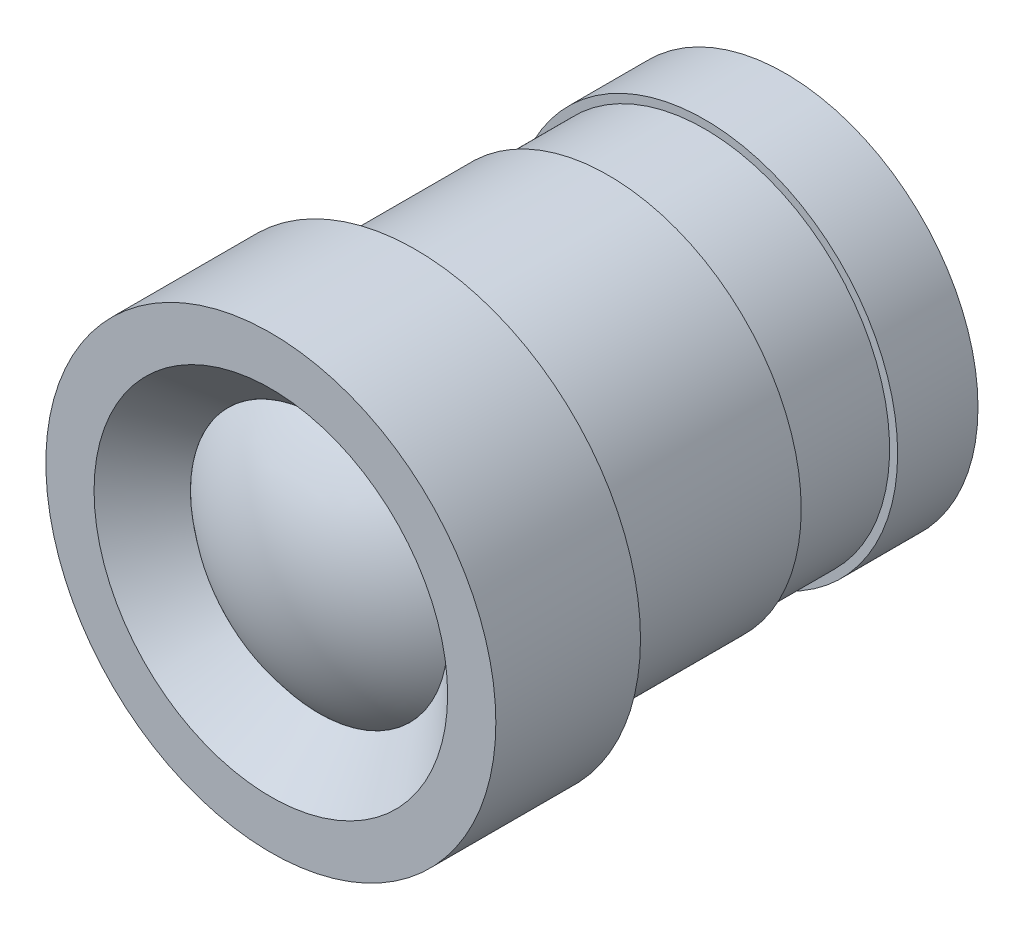
ISO-10303-21;
HEADER;
FILE_DESCRIPTION(('STEP AP214'),'2;1');
FILE_NAME('part.step','',(''),(''),'','','');
FILE_SCHEMA(('AUTOMOTIVE_DESIGN { 1 0 10303 214 1 1 1 1 }'));
ENDSEC;
DATA;
#1=APPLICATION_CONTEXT('core data for automotive mechanical design processes');
#2=APPLICATION_PROTOCOL_DEFINITION('international standard','automotive_design',2000,#1);
#3=PRODUCT_CONTEXT('',#1,'mechanical');
#4=PRODUCT('Part','Part','',(#3));
#5=PRODUCT_RELATED_PRODUCT_CATEGORY('part','',(#4));
#6=PRODUCT_DEFINITION_FORMATION('','',#4);
#7=PRODUCT_DEFINITION_CONTEXT('part definition',#1,'design');
#8=PRODUCT_DEFINITION('design','',#6,#7);
#9=PRODUCT_DEFINITION_SHAPE('','',#8);
#10=(LENGTH_UNIT() NAMED_UNIT(*) SI_UNIT(.MILLI.,.METRE.));
#11=(NAMED_UNIT(*) PLANE_ANGLE_UNIT() SI_UNIT($,.RADIAN.));
#12=(NAMED_UNIT(*) SI_UNIT($,.STERADIAN.) SOLID_ANGLE_UNIT());
#13=UNCERTAINTY_MEASURE_WITH_UNIT(LENGTH_MEASURE(1.E-05),#10,'distance_accuracy_value','');
#14=(GEOMETRIC_REPRESENTATION_CONTEXT(3) GLOBAL_UNCERTAINTY_ASSIGNED_CONTEXT((#13)) GLOBAL_UNIT_ASSIGNED_CONTEXT((#10,
#11,#12)) REPRESENTATION_CONTEXT('',''));
#15=CARTESIAN_POINT('',(0.,0.,0.));
#16=DIRECTION('',(0.,0.,1.));
#17=DIRECTION('',(1.,0.,0.));
#18=AXIS2_PLACEMENT_3D('',#15,#16,#17);
#19=CARTESIAN_POINT('',(0.,0.,-4.58333333333333));
#20=DIRECTION('',(0.,0.,1.));
#21=DIRECTION('',(-1.,0.,0.));
#22=AXIS2_PLACEMENT_3D('',#19,#20,#21);
#23=SPHERICAL_SURFACE('',#22,6.08333333333333);
#24=CARTESIAN_POINT('',(0.,0.,0.));
#25=DIRECTION('',(0.,0.,1.));
#26=DIRECTION('',(1.,0.,0.));
#27=AXIS2_PLACEMENT_3D('',#24,#25,#26);
#28=CIRCLE('',#27,4.);
#29=CARTESIAN_POINT('',(4.,0.,0.));
#30=VERTEX_POINT('',#29);
#31=EDGE_CURVE('E56',#30,#30,#28,.T.);
#32=ORIENTED_EDGE('',*,*,#31,.T.);
#33=EDGE_LOOP('',(#32));
#34=FACE_BOUND('',#33,.T.);
#35=ADVANCED_FACE('F50',(#34),#23,.T.);
#36=CARTESIAN_POINT('',(4.,0.,-14.5));
#37=DIRECTION('',(0.,0.,-1.));
#38=DIRECTION('',(-1.,0.,0.));
#39=AXIS2_PLACEMENT_3D('',#36,#37,#38);
#40=PLANE('',#39);
#41=CARTESIAN_POINT('',(0.,0.,-14.5));
#42=DIRECTION('',(0.,0.,1.));
#43=DIRECTION('',(1.,0.,0.));
#44=AXIS2_PLACEMENT_3D('',#41,#42,#43);
#45=CIRCLE('',#44,4.);
#46=CARTESIAN_POINT('',(4.,0.,-14.5));
#47=VERTEX_POINT('',#46);
#48=EDGE_CURVE('E11',#47,#47,#45,.T.);
#49=ORIENTED_EDGE('',*,*,#48,.F.);
#50=EDGE_LOOP('',(#49));
#51=FACE_BOUND('',#50,.T.);
#52=ADVANCED_FACE('F65',(#51),#40,.T.);
#53=CARTESIAN_POINT('',(0.,0.,1.5));
#54=DIRECTION('',(0.,0.,1.));
#55=DIRECTION('',(1.,0.,0.));
#56=AXIS2_PLACEMENT_3D('',#53,#54,#55);
#57=CYLINDRICAL_SURFACE('',#56,4.);
#58=ORIENTED_EDGE('',*,*,#48,.T.);
#59=EDGE_LOOP('',(#58));
#60=FACE_BOUND('',#59,.T.);
#61=ORIENTED_EDGE('',*,*,#31,.F.);
#62=EDGE_LOOP('',(#61));
#63=FACE_BOUND('',#62,.T.);
#64=ADVANCED_FACE('F63',(#60,#63),#57,.T.);
#65=CLOSED_SHELL('',(#35,#52,#64));
#66=MANIFOLD_SOLID_BREP('B2',#65);
#67=CARTESIAN_POINT('',(0.,0.,1.5));
#68=DIRECTION('',(0.,0.,1.));
#69=DIRECTION('',(1.,0.,0.));
#70=AXIS2_PLACEMENT_3D('',#67,#68,#69);
#71=CYLINDRICAL_SURFACE('',#70,6.);
#72=CARTESIAN_POINT('',(0.,0.,-3.));
#73=DIRECTION('',(0.,0.,1.));
#74=DIRECTION('',(1.,0.,0.));
#75=AXIS2_PLACEMENT_3D('',#72,#73,#74);
#76=CIRCLE('',#75,6.);
#77=CARTESIAN_POINT('',(6.,0.,-3.));
#78=VERTEX_POINT('',#77);
#79=EDGE_CURVE('E122',#78,#78,#76,.T.);
#80=ORIENTED_EDGE('',*,*,#79,.F.);
#81=EDGE_LOOP('',(#80));
#82=FACE_BOUND('',#81,.T.);
#83=CARTESIAN_POINT('',(0.,0.,-9.));
#84=DIRECTION('',(0.,0.,-1.));
#85=DIRECTION('',(-1.,0.,0.));
#86=AXIS2_PLACEMENT_3D('',#83,#84,#85);
#87=CIRCLE('',#86,6.);
#88=CARTESIAN_POINT('',(-6.,0.,-9.));
#89=VERTEX_POINT('',#88);
#90=EDGE_CURVE('E142',#89,#89,#87,.T.);
#91=ORIENTED_EDGE('',*,*,#90,.F.);
#92=EDGE_LOOP('',(#91));
#93=FACE_BOUND('',#92,.T.);
#94=ADVANCED_FACE('F109',(#82,#93),#71,.T.);
#95=CARTESIAN_POINT('',(0.,0.,1.5));
#96=DIRECTION('',(0.,0.,-1.));
#97=DIRECTION('',(-1.,0.,0.));
#98=AXIS2_PLACEMENT_3D('',#95,#96,#97);
#99=PLANE('',#98);
#100=CARTESIAN_POINT('',(0.,0.,1.5));
#101=DIRECTION('',(0.,0.,1.));
#102=DIRECTION('',(1.,0.,0.));
#103=AXIS2_PLACEMENT_3D('',#100,#101,#102);
#104=CIRCLE('',#103,5.5);
#105=CARTESIAN_POINT('',(5.5,0.,1.5));
#106=VERTEX_POINT('',#105);
#107=EDGE_CURVE('E133',#106,#106,#104,.T.);
#108=ORIENTED_EDGE('',*,*,#107,.F.);
#109=EDGE_LOOP('',(#108));
#110=FACE_BOUND('',#109,.T.);
#111=CARTESIAN_POINT('',(0.,0.,1.5));
#112=DIRECTION('',(0.,0.,1.));
#113=DIRECTION('',(1.,0.,0.));
#114=AXIS2_PLACEMENT_3D('',#111,#112,#113);
#115=CIRCLE('',#114,7.);
#116=CARTESIAN_POINT('',(7.,0.,1.5));
#117=VERTEX_POINT('',#116);
#118=EDGE_CURVE('E49',#117,#117,#115,.T.);
#119=ORIENTED_EDGE('',*,*,#118,.T.);
#120=EDGE_LOOP('',(#119));
#121=FACE_BOUND('',#120,.T.);
#122=ADVANCED_FACE('F111',(#110,#121),#99,.F.);
#123=CARTESIAN_POINT('',(0.,0.,1.5));
#124=DIRECTION('',(0.,0.,1.));
#125=DIRECTION('',(1.,0.,0.));
#126=AXIS2_PLACEMENT_3D('',#123,#124,#125);
#127=CYLINDRICAL_SURFACE('',#126,7.);
#128=ORIENTED_EDGE('',*,*,#118,.F.);
#129=EDGE_LOOP('',(#128));
#130=FACE_BOUND('',#129,.T.);
#131=CARTESIAN_POINT('',(0.,0.,-3.));
#132=DIRECTION('',(0.,0.,1.));
#133=DIRECTION('',(1.,0.,0.));
#134=AXIS2_PLACEMENT_3D('',#131,#132,#133);
#135=CIRCLE('',#134,7.);
#136=CARTESIAN_POINT('',(7.,0.,-3.));
#137=VERTEX_POINT('',#136);
#138=EDGE_CURVE('E117',#137,#137,#135,.T.);
#139=ORIENTED_EDGE('',*,*,#138,.T.);
#140=EDGE_LOOP('',(#139));
#141=FACE_BOUND('',#140,.T.);
#142=ADVANCED_FACE('F182',(#130,#141),#127,.T.);
#143=CARTESIAN_POINT('',(0.,7.,-3.));
#144=DIRECTION('',(0.,0.,1.));
#145=DIRECTION('',(1.,0.,0.));
#146=AXIS2_PLACEMENT_3D('',#143,#144,#145);
#147=PLANE('',#146);
#148=ORIENTED_EDGE('',*,*,#138,.F.);
#149=EDGE_LOOP('',(#148));
#150=FACE_BOUND('',#149,.T.);
#151=ORIENTED_EDGE('',*,*,#79,.T.);
#152=EDGE_LOOP('',(#151));
#153=FACE_BOUND('',#152,.T.);
#154=ADVANCED_FACE('F188',(#150,#153),#147,.F.);
#155=CARTESIAN_POINT('',(0.,0.,-12.));
#156=DIRECTION('',(0.,0.,-1.));
#157=DIRECTION('',(-1.,0.,0.));
#158=AXIS2_PLACEMENT_3D('',#155,#156,#157);
#159=CIRCLE('',#158,6.);
#160=CARTESIAN_POINT('',(-6.,0.,-12.));
#161=VERTEX_POINT('',#160);
#162=EDGE_CURVE('E146',#161,#161,#159,.T.);
#163=ORIENTED_EDGE('',*,*,#162,.T.);
#164=EDGE_LOOP('',(#163));
#165=FACE_BOUND('',#164,.T.);
#166=CARTESIAN_POINT('',(0.,0.,-14.5));
#167=DIRECTION('',(0.,0.,1.));
#168=DIRECTION('',(1.,0.,0.));
#169=AXIS2_PLACEMENT_3D('',#166,#167,#168);
#170=CIRCLE('',#169,6.);
#171=CARTESIAN_POINT('',(6.,0.,-14.5));
#172=VERTEX_POINT('',#171);
#173=EDGE_CURVE('E127',#172,#172,#170,.T.);
#174=ORIENTED_EDGE('',*,*,#173,.T.);
#175=EDGE_LOOP('',(#174));
#176=FACE_BOUND('',#175,.T.);
#177=ADVANCED_FACE('F176',(#165,#176),#71,.T.);
#178=CARTESIAN_POINT('',(0.,6.,-14.5));
#179=DIRECTION('',(0.,0.,1.));
#180=DIRECTION('',(1.,0.,0.));
#181=AXIS2_PLACEMENT_3D('',#178,#179,#180);
#182=PLANE('',#181);
#183=CARTESIAN_POINT('',(0.,0.,-14.5));
#184=DIRECTION('',(0.,0.,1.));
#185=DIRECTION('',(1.,0.,0.));
#186=AXIS2_PLACEMENT_3D('',#183,#184,#185);
#187=CIRCLE('',#186,3.99999999999999);
#188=CARTESIAN_POINT('',(3.99999999999999,0.,-14.5));
#189=VERTEX_POINT('',#188);
#190=EDGE_CURVE('E137',#189,#189,#187,.T.);
#191=ORIENTED_EDGE('',*,*,#190,.T.);
#192=EDGE_LOOP('',(#191));
#193=FACE_BOUND('',#192,.T.);
#194=ORIENTED_EDGE('',*,*,#173,.F.);
#195=EDGE_LOOP('',(#194));
#196=FACE_BOUND('',#195,.T.);
#197=ADVANCED_FACE('F187',(#193,#196),#182,.F.);
#198=CARTESIAN_POINT('',(0.,0.,1.5));
#199=DIRECTION('',(0.,0.,1.));
#200=DIRECTION('',(1.,0.,0.));
#201=AXIS2_PLACEMENT_3D('',#198,#199,#200);
#202=CONICAL_SURFACE('',#201,5.5,0.78539816339745);
#203=CARTESIAN_POINT('',(0.,0.,0.));
#204=DIRECTION('',(0.,0.,1.));
#205=DIRECTION('',(1.,0.,0.));
#206=AXIS2_PLACEMENT_3D('',#203,#204,#205);
#207=CIRCLE('',#206,3.99999999999999);
#208=CARTESIAN_POINT('',(3.99999999999999,0.,0.));
#209=VERTEX_POINT('',#208);
#210=EDGE_CURVE('E138',#209,#209,#207,.T.);
#211=ORIENTED_EDGE('',*,*,#210,.F.);
#212=EDGE_LOOP('',(#211));
#213=FACE_BOUND('',#212,.T.);
#214=ORIENTED_EDGE('',*,*,#107,.T.);
#215=EDGE_LOOP('',(#214));
#216=FACE_BOUND('',#215,.T.);
#217=ADVANCED_FACE('F193',(#213,#216),#202,.F.);
#218=CARTESIAN_POINT('',(0.,0.,-14.5));
#219=DIRECTION('',(0.,0.,1.));
#220=DIRECTION('',(1.,0.,0.));
#221=AXIS2_PLACEMENT_3D('',#218,#219,#220);
#222=CYLINDRICAL_SURFACE('',#221,3.99999999999999);
#223=ORIENTED_EDGE('',*,*,#190,.F.);
#224=EDGE_LOOP('',(#223));
#225=FACE_BOUND('',#224,.T.);
#226=ORIENTED_EDGE('',*,*,#210,.T.);
#227=EDGE_LOOP('',(#226));
#228=FACE_BOUND('',#227,.T.);
#229=ADVANCED_FACE('F169',(#225,#228),#222,.F.);
#230=CARTESIAN_POINT('',(0.,0.,-9.));
#231=DIRECTION('',(0.,0.,-1.));
#232=DIRECTION('',(-1.,0.,0.));
#233=AXIS2_PLACEMENT_3D('',#230,#231,#232);
#234=PLANE('',#233);
#235=CARTESIAN_POINT('',(0.,0.,-9.));
#236=DIRECTION('',(0.,0.,-1.));
#237=DIRECTION('',(-1.,0.,0.));
#238=AXIS2_PLACEMENT_3D('',#235,#236,#237);
#239=CIRCLE('',#238,5.75);
#240=CARTESIAN_POINT('',(-5.75,0.,-9.));
#241=VERTEX_POINT('',#240);
#242=EDGE_CURVE('E150',#241,#241,#239,.T.);
#243=ORIENTED_EDGE('',*,*,#242,.F.);
#244=EDGE_LOOP('',(#243));
#245=FACE_BOUND('',#244,.T.);
#246=ORIENTED_EDGE('',*,*,#90,.T.);
#247=EDGE_LOOP('',(#246));
#248=FACE_BOUND('',#247,.T.);
#249=ADVANCED_FACE('F165',(#245,#248),#234,.T.);
#250=CARTESIAN_POINT('',(0.,0.,-12.));
#251=DIRECTION('',(0.,0.,-1.));
#252=DIRECTION('',(-1.,0.,0.));
#253=AXIS2_PLACEMENT_3D('',#250,#251,#252);
#254=PLANE('',#253);
#255=CARTESIAN_POINT('',(0.,0.,-12.));
#256=DIRECTION('',(0.,0.,-1.));
#257=DIRECTION('',(-1.,0.,0.));
#258=AXIS2_PLACEMENT_3D('',#255,#256,#257);
#259=CIRCLE('',#258,5.75);
#260=CARTESIAN_POINT('',(-5.75,0.,-12.));
#261=VERTEX_POINT('',#260);
#262=EDGE_CURVE('E154',#261,#261,#259,.T.);
#263=ORIENTED_EDGE('',*,*,#262,.T.);
#264=EDGE_LOOP('',(#263));
#265=FACE_BOUND('',#264,.T.);
#266=ORIENTED_EDGE('',*,*,#162,.F.);
#267=EDGE_LOOP('',(#266));
#268=FACE_BOUND('',#267,.T.);
#269=ADVANCED_FACE('F168',(#265,#268),#254,.F.);
#270=CARTESIAN_POINT('',(0.,0.,-9.));
#271=DIRECTION('',(0.,0.,-1.));
#272=DIRECTION('',(-1.,0.,0.));
#273=AXIS2_PLACEMENT_3D('',#270,#271,#272);
#274=CYLINDRICAL_SURFACE('',#273,5.75);
#275=ORIENTED_EDGE('',*,*,#242,.T.);
#276=EDGE_LOOP('',(#275));
#277=FACE_BOUND('',#276,.T.);
#278=ORIENTED_EDGE('',*,*,#262,.F.);
#279=EDGE_LOOP('',(#278));
#280=FACE_BOUND('',#279,.T.);
#281=ADVANCED_FACE('F162',(#277,#280),#274,.T.);
#282=CLOSED_SHELL('',(#94,#122,#142,#154,#177,#197,#217,#229,#249,#269,#281));
#283=MANIFOLD_SOLID_BREP('B6',#282);
#284=ADVANCED_BREP_SHAPE_REPRESENTATION('',(#18,#66,#283),#14);
#285=SHAPE_DEFINITION_REPRESENTATION(#9,#284);
ENDSEC;
END-ISO-10303-21;
